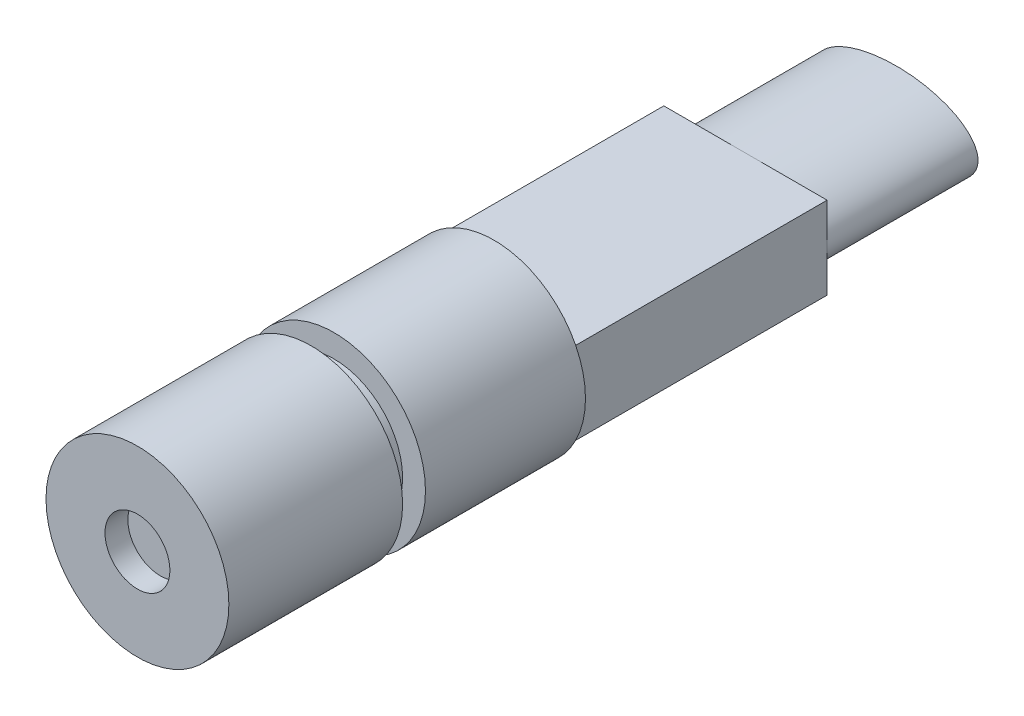
ISO-10303-21;
HEADER;
FILE_DESCRIPTION(('STEP AP214'),'2;1');
FILE_NAME('part.step','',(''),(''),'','','');
FILE_SCHEMA(('AUTOMOTIVE_DESIGN { 1 0 10303 214 1 1 1 1 }'));
ENDSEC;
DATA;
#1=APPLICATION_CONTEXT('core data for automotive mechanical design processes');
#2=APPLICATION_PROTOCOL_DEFINITION('international standard','automotive_design',2000,#1);
#3=PRODUCT_CONTEXT('',#1,'mechanical');
#4=PRODUCT('Part','Part','',(#3));
#5=PRODUCT_RELATED_PRODUCT_CATEGORY('part','',(#4));
#6=PRODUCT_DEFINITION_FORMATION('','',#4);
#7=PRODUCT_DEFINITION_CONTEXT('part definition',#1,'design');
#8=PRODUCT_DEFINITION('design','',#6,#7);
#9=PRODUCT_DEFINITION_SHAPE('','',#8);
#10=(LENGTH_UNIT() NAMED_UNIT(*) SI_UNIT(.MILLI.,.METRE.));
#11=(NAMED_UNIT(*) PLANE_ANGLE_UNIT() SI_UNIT($,.RADIAN.));
#12=(NAMED_UNIT(*) SI_UNIT($,.STERADIAN.) SOLID_ANGLE_UNIT());
#13=UNCERTAINTY_MEASURE_WITH_UNIT(LENGTH_MEASURE(1.E-05),#10,'distance_accuracy_value','');
#14=(GEOMETRIC_REPRESENTATION_CONTEXT(3) GLOBAL_UNCERTAINTY_ASSIGNED_CONTEXT((#13)) GLOBAL_UNIT_ASSIGNED_CONTEXT((#10,
#11,#12)) REPRESENTATION_CONTEXT('',''));
#15=CARTESIAN_POINT('',(0.,0.,0.));
#16=DIRECTION('',(0.,0.,1.));
#17=DIRECTION('',(1.,0.,0.));
#18=AXIS2_PLACEMENT_3D('',#15,#16,#17);
#19=CARTESIAN_POINT('',(0.,0.,-5.5));
#20=DIRECTION('',(0.,0.,1.));
#21=DIRECTION('',(1.,0.,0.));
#22=AXIS2_PLACEMENT_3D('',#19,#20,#21);
#23=PLANE('',#22);
#24=CARTESIAN_POINT('',(0.,0.,-5.5));
#25=DIRECTION('',(0.,0.,-1.));
#26=DIRECTION('',(-1.,0.,0.));
#27=AXIS2_PLACEMENT_3D('',#24,#25,#26);
#28=ELLIPSE('',#27,1.78605710994917,0.9);
#29=CARTESIAN_POINT('',(-1.78605710994917,0.,-5.5));
#30=VERTEX_POINT('',#29);
#31=CARTESIAN_POINT('',(0.,0.9,-5.5));
#32=VERTEX_POINT('',#31);
#33=EDGE_CURVE('E53',#30,#32,#28,.T.);
#34=ORIENTED_EDGE('',*,*,#33,.F.);
#35=DIRECTION('',(0.,-1.,0.));
#36=VECTOR('',#35,1.);
#37=CARTESIAN_POINT('',(-1.78605710994917,0.9,-5.5));
#38=LINE('',#37,#36);
#39=CARTESIAN_POINT('',(-1.78605710994917,0.9,-5.5));
#40=VERTEX_POINT('',#39);
#41=EDGE_CURVE('E100',#40,#30,#38,.T.);
#42=ORIENTED_EDGE('',*,*,#41,.F.);
#43=DIRECTION('',(-1.,0.,0.));
#44=VECTOR('',#43,1.);
#45=CARTESIAN_POINT('',(-1.78605710994917,0.9,-5.5));
#46=LINE('',#45,#44);
#47=EDGE_CURVE('E117',#32,#40,#46,.T.);
#48=ORIENTED_EDGE('',*,*,#47,.F.);
#49=EDGE_LOOP('',(#34,#42,#48));
#50=FACE_BOUND('',#49,.T.);
#51=ADVANCED_FACE('F41',(#50),#23,.F.);
#52=CARTESIAN_POINT('',(1.78605710994917,0.,-5.5));
#53=VERTEX_POINT('',#52);
#54=EDGE_CURVE('E11',#32,#53,#28,.T.);
#55=ORIENTED_EDGE('',*,*,#54,.F.);
#56=CARTESIAN_POINT('',(1.78605710994917,0.9,-5.5));
#57=VERTEX_POINT('',#56);
#58=EDGE_CURVE('E115',#57,#32,#46,.T.);
#59=ORIENTED_EDGE('',*,*,#58,.F.);
#60=DIRECTION('',(0.,1.,0.));
#61=VECTOR('',#60,1.);
#62=CARTESIAN_POINT('',(1.78605710994917,0.9,-5.5));
#63=LINE('',#62,#61);
#64=EDGE_CURVE('E136',#53,#57,#63,.T.);
#65=ORIENTED_EDGE('',*,*,#64,.F.);
#66=EDGE_LOOP('',(#55,#59,#65));
#67=FACE_BOUND('',#66,.T.);
#68=ADVANCED_FACE('F219',(#67),#23,.F.);
#69=CARTESIAN_POINT('',(0.,-0.9,-5.5));
#70=VERTEX_POINT('',#69);
#71=EDGE_CURVE('E51',#53,#70,#28,.T.);
#72=ORIENTED_EDGE('',*,*,#71,.F.);
#73=CARTESIAN_POINT('',(1.78605710994917,-0.9,-5.5));
#74=VERTEX_POINT('',#73);
#75=EDGE_CURVE('E132',#74,#53,#63,.T.);
#76=ORIENTED_EDGE('',*,*,#75,.F.);
#77=DIRECTION('',(1.,0.,0.));
#78=VECTOR('',#77,1.);
#79=CARTESIAN_POINT('',(-1.78605710994917,-0.9,-5.5));
#80=LINE('',#79,#78);
#81=EDGE_CURVE('E109',#70,#74,#80,.T.);
#82=ORIENTED_EDGE('',*,*,#81,.F.);
#83=EDGE_LOOP('',(#72,#76,#82));
#84=FACE_BOUND('',#83,.T.);
#85=ADVANCED_FACE('F224',(#84),#23,.F.);
#86=CARTESIAN_POINT('',(0.,0.,0.));
#87=DIRECTION('',(0.,0.,1.));
#88=DIRECTION('',(1.,0.,0.));
#89=AXIS2_PLACEMENT_3D('',#86,#87,#88);
#90=PLANE('',#89);
#91=CARTESIAN_POINT('',(0.,0.,0.));
#92=DIRECTION('',(0.,0.,1.));
#93=DIRECTION('',(1.,0.,0.));
#94=AXIS2_PLACEMENT_3D('',#91,#92,#93);
#95=CIRCLE('',#94,2.);
#96=CARTESIAN_POINT('',(1.78605710994918,-0.9,0.));
#97=VERTEX_POINT('',#96);
#98=CARTESIAN_POINT('',(1.78605710994917,0.9,0.));
#99=VERTEX_POINT('',#98);
#100=EDGE_CURVE('E190',#97,#99,#95,.T.);
#101=ORIENTED_EDGE('',*,*,#100,.F.);
#102=DIRECTION('',(0.,1.,0.));
#103=VECTOR('',#102,1.);
#104=CARTESIAN_POINT('',(1.78605710994917,0.9,0.));
#105=LINE('',#104,#103);
#106=EDGE_CURVE('E142',#97,#99,#105,.T.);
#107=ORIENTED_EDGE('',*,*,#106,.T.);
#108=EDGE_LOOP('',(#101,#107));
#109=FACE_BOUND('',#108,.T.);
#110=ADVANCED_FACE('F212',(#109),#90,.F.);
#111=CARTESIAN_POINT('',(-1.78605710994917,0.9,0.));
#112=VERTEX_POINT('',#111);
#113=EDGE_CURVE('E45',#99,#112,#95,.T.);
#114=ORIENTED_EDGE('',*,*,#113,.F.);
#115=DIRECTION('',(-1.,0.,0.));
#116=VECTOR('',#115,1.);
#117=CARTESIAN_POINT('',(-1.78605710994917,0.9,0.));
#118=LINE('',#117,#116);
#119=EDGE_CURVE('E146',#99,#112,#118,.T.);
#120=ORIENTED_EDGE('',*,*,#119,.T.);
#121=EDGE_LOOP('',(#114,#120));
#122=FACE_BOUND('',#121,.T.);
#123=ADVANCED_FACE('F242',(#122),#90,.F.);
#124=CARTESIAN_POINT('',(-1.78605710994917,-0.9,0.));
#125=VERTEX_POINT('',#124);
#126=EDGE_CURVE('E262',#112,#125,#95,.T.);
#127=ORIENTED_EDGE('',*,*,#126,.F.);
#128=DIRECTION('',(0.,-1.,0.));
#129=VECTOR('',#128,1.);
#130=CARTESIAN_POINT('',(-1.78605710994917,0.9,0.));
#131=LINE('',#130,#129);
#132=EDGE_CURVE('E150',#112,#125,#131,.T.);
#133=ORIENTED_EDGE('',*,*,#132,.T.);
#134=EDGE_LOOP('',(#127,#133));
#135=FACE_BOUND('',#134,.T.);
#136=ADVANCED_FACE('F213',(#135),#90,.F.);
#137=CARTESIAN_POINT('',(0.,0.,7.8));
#138=DIRECTION('',(0.,0.,-1.));
#139=DIRECTION('',(-1.,0.,0.));
#140=AXIS2_PLACEMENT_3D('',#137,#138,#139);
#141=CYLINDRICAL_SURFACE('',#140,2.);
#142=CARTESIAN_POINT('',(0.,0.,4.));
#143=DIRECTION('',(0.,0.,1.));
#144=DIRECTION('',(1.,0.,0.));
#145=AXIS2_PLACEMENT_3D('',#142,#143,#144);
#146=CIRCLE('',#145,2.);
#147=CARTESIAN_POINT('',(2.,0.,4.));
#148=VERTEX_POINT('',#147);
#149=EDGE_CURVE('E186',#148,#148,#146,.T.);
#150=ORIENTED_EDGE('',*,*,#149,.T.);
#151=EDGE_LOOP('',(#150));
#152=FACE_BOUND('',#151,.T.);
#153=CARTESIAN_POINT('',(0.,0.,7.8));
#154=DIRECTION('',(0.,0.,1.));
#155=DIRECTION('',(1.,0.,0.));
#156=AXIS2_PLACEMENT_3D('',#153,#154,#155);
#157=CIRCLE('',#156,2.);
#158=CARTESIAN_POINT('',(2.,0.,7.8));
#159=VERTEX_POINT('',#158);
#160=EDGE_CURVE('E125',#159,#159,#157,.T.);
#161=ORIENTED_EDGE('',*,*,#160,.F.);
#162=EDGE_LOOP('',(#161));
#163=FACE_BOUND('',#162,.T.);
#164=ADVANCED_FACE('F43',(#152,#163),#141,.T.);
#165=CARTESIAN_POINT('',(0.,0.,7.8));
#166=DIRECTION('',(0.,0.,1.));
#167=DIRECTION('',(1.,0.,0.));
#168=AXIS2_PLACEMENT_3D('',#165,#166,#167);
#169=PLANE('',#168);
#170=CARTESIAN_POINT('',(0.,0.,7.8));
#171=DIRECTION('',(0.,0.,1.));
#172=DIRECTION('',(1.,0.,0.));
#173=AXIS2_PLACEMENT_3D('',#170,#171,#172);
#174=CIRCLE('',#173,0.71);
#175=CARTESIAN_POINT('',(0.71,0.,7.8));
#176=VERTEX_POINT('',#175);
#177=EDGE_CURVE('E162',#176,#176,#174,.T.);
#178=ORIENTED_EDGE('',*,*,#177,.F.);
#179=EDGE_LOOP('',(#178));
#180=FACE_BOUND('',#179,.T.);
#181=ORIENTED_EDGE('',*,*,#160,.T.);
#182=EDGE_LOOP('',(#181));
#183=FACE_BOUND('',#182,.T.);
#184=ADVANCED_FACE('F216',(#180,#183),#169,.T.);
#185=CARTESIAN_POINT('',(0.,0.,4.));
#186=DIRECTION('',(0.,0.,1.));
#187=DIRECTION('',(1.,0.,0.));
#188=AXIS2_PLACEMENT_3D('',#185,#186,#187);
#189=PLANE('',#188);
#190=ORIENTED_EDGE('',*,*,#149,.F.);
#191=EDGE_LOOP('',(#190));
#192=FACE_BOUND('',#191,.T.);
#193=CARTESIAN_POINT('',(0.,0.,4.));
#194=DIRECTION('',(0.,0.,1.));
#195=DIRECTION('',(1.,0.,0.));
#196=AXIS2_PLACEMENT_3D('',#193,#194,#195);
#197=CIRCLE('',#196,1.5);
#198=CARTESIAN_POINT('',(1.5,0.,4.));
#199=VERTEX_POINT('',#198);
#200=EDGE_CURVE('E178',#199,#199,#197,.T.);
#201=ORIENTED_EDGE('',*,*,#200,.T.);
#202=EDGE_LOOP('',(#201));
#203=FACE_BOUND('',#202,.T.);
#204=ADVANCED_FACE('F276',(#192,#203),#189,.F.);
#205=CARTESIAN_POINT('',(0.,0.,3.5));
#206=DIRECTION('',(0.,0.,1.));
#207=DIRECTION('',(1.,0.,0.));
#208=AXIS2_PLACEMENT_3D('',#205,#206,#207);
#209=PLANE('',#208);
#210=CARTESIAN_POINT('',(0.,0.,3.5));
#211=DIRECTION('',(0.,0.,1.));
#212=DIRECTION('',(1.,0.,0.));
#213=AXIS2_PLACEMENT_3D('',#210,#211,#212);
#214=CIRCLE('',#213,2.);
#215=CARTESIAN_POINT('',(2.,0.,3.5));
#216=VERTEX_POINT('',#215);
#217=EDGE_CURVE('E182',#216,#216,#214,.T.);
#218=ORIENTED_EDGE('',*,*,#217,.T.);
#219=EDGE_LOOP('',(#218));
#220=FACE_BOUND('',#219,.T.);
#221=CARTESIAN_POINT('',(0.,0.,3.5));
#222=DIRECTION('',(0.,0.,1.));
#223=DIRECTION('',(1.,0.,0.));
#224=AXIS2_PLACEMENT_3D('',#221,#222,#223);
#225=CIRCLE('',#224,1.5);
#226=CARTESIAN_POINT('',(1.5,0.,3.5));
#227=VERTEX_POINT('',#226);
#228=EDGE_CURVE('E174',#227,#227,#225,.T.);
#229=ORIENTED_EDGE('',*,*,#228,.F.);
#230=EDGE_LOOP('',(#229));
#231=FACE_BOUND('',#230,.T.);
#232=ADVANCED_FACE('F195',(#220,#231),#209,.T.);
#233=CARTESIAN_POINT('',(0.,0.,4.));
#234=DIRECTION('',(0.,0.,-1.));
#235=DIRECTION('',(-1.,0.,0.));
#236=AXIS2_PLACEMENT_3D('',#233,#234,#235);
#237=CYLINDRICAL_SURFACE('',#236,1.5);
#238=ORIENTED_EDGE('',*,*,#200,.F.);
#239=EDGE_LOOP('',(#238));
#240=FACE_BOUND('',#239,.T.);
#241=ORIENTED_EDGE('',*,*,#228,.T.);
#242=EDGE_LOOP('',(#241));
#243=FACE_BOUND('',#242,.T.);
#244=ADVANCED_FACE('F210',(#240,#243),#237,.T.);
#245=EDGE_CURVE('E256',#125,#97,#95,.T.);
#246=ORIENTED_EDGE('',*,*,#245,.F.);
#247=DIRECTION('',(1.,0.,0.));
#248=VECTOR('',#247,1.);
#249=CARTESIAN_POINT('',(-1.78605710994917,-0.9,0.));
#250=LINE('',#249,#248);
#251=EDGE_CURVE('E154',#125,#97,#250,.T.);
#252=ORIENTED_EDGE('',*,*,#251,.T.);
#253=EDGE_LOOP('',(#246,#252));
#254=FACE_BOUND('',#253,.T.);
#255=ADVANCED_FACE('F201',(#254),#90,.F.);
#256=ORIENTED_EDGE('',*,*,#113,.T.);
#257=ORIENTED_EDGE('',*,*,#126,.T.);
#258=ORIENTED_EDGE('',*,*,#245,.T.);
#259=ORIENTED_EDGE('',*,*,#100,.T.);
#260=EDGE_LOOP('',(#256,#257,#258,#259));
#261=FACE_BOUND('',#260,.T.);
#262=ORIENTED_EDGE('',*,*,#217,.F.);
#263=EDGE_LOOP('',(#262));
#264=FACE_BOUND('',#263,.T.);
#265=ADVANCED_FACE('F198',(#261,#264),#141,.T.);
#266=CARTESIAN_POINT('',(0.,0.,7.3));
#267=DIRECTION('',(0.,0.,1.));
#268=DIRECTION('',(1.,0.,0.));
#269=AXIS2_PLACEMENT_3D('',#266,#267,#268);
#270=CYLINDRICAL_SURFACE('',#269,0.71);
#271=CARTESIAN_POINT('',(0.,0.,7.3));
#272=DIRECTION('',(0.,0.,1.));
#273=DIRECTION('',(1.,0.,0.));
#274=AXIS2_PLACEMENT_3D('',#271,#272,#273);
#275=CIRCLE('',#274,0.71);
#276=CARTESIAN_POINT('',(0.71,0.,7.3));
#277=VERTEX_POINT('',#276);
#278=EDGE_CURVE('E170',#277,#277,#275,.T.);
#279=ORIENTED_EDGE('',*,*,#278,.F.);
#280=EDGE_LOOP('',(#279));
#281=FACE_BOUND('',#280,.T.);
#282=ORIENTED_EDGE('',*,*,#177,.T.);
#283=EDGE_LOOP('',(#282));
#284=FACE_BOUND('',#283,.T.);
#285=ADVANCED_FACE('F200',(#281,#284),#270,.F.);
#286=CARTESIAN_POINT('',(0.,0.,7.3));
#287=DIRECTION('',(0.,0.,1.));
#288=DIRECTION('',(1.,0.,0.));
#289=AXIS2_PLACEMENT_3D('',#286,#287,#288);
#290=PLANE('',#289);
#291=ORIENTED_EDGE('',*,*,#278,.T.);
#292=EDGE_LOOP('',(#291));
#293=FACE_BOUND('',#292,.T.);
#294=ADVANCED_FACE('F207',(#293),#290,.T.);
#295=CARTESIAN_POINT('',(1.78605710994917,0.9,-5.5));
#296=DIRECTION('',(1.,0.,0.));
#297=DIRECTION('',(0.,0.,-1.));
#298=AXIS2_PLACEMENT_3D('',#295,#296,#297);
#299=PLANE('',#298);
#300=ORIENTED_EDGE('',*,*,#106,.F.);
#301=DIRECTION('',(0.,0.,1.));
#302=VECTOR('',#301,1.);
#303=CARTESIAN_POINT('',(1.78605710994917,-0.9,-5.5));
#304=LINE('',#303,#302);
#305=EDGE_CURVE('E158',#74,#97,#304,.T.);
#306=ORIENTED_EDGE('',*,*,#305,.F.);
#307=ORIENTED_EDGE('',*,*,#75,.T.);
#308=ORIENTED_EDGE('',*,*,#64,.T.);
#309=DIRECTION('',(0.,0.,1.));
#310=VECTOR('',#309,1.);
#311=CARTESIAN_POINT('',(1.78605710994917,0.9,-5.5));
#312=LINE('',#311,#310);
#313=EDGE_CURVE('E141',#57,#99,#312,.T.);
#314=ORIENTED_EDGE('',*,*,#313,.T.);
#315=EDGE_LOOP('',(#300,#306,#307,#308,#314));
#316=FACE_BOUND('',#315,.T.);
#317=ADVANCED_FACE('F249',(#316),#299,.T.);
#318=CARTESIAN_POINT('',(-1.78605710994917,-0.9,-5.5));
#319=DIRECTION('',(0.,-1.,0.));
#320=DIRECTION('',(0.,0.,-1.));
#321=AXIS2_PLACEMENT_3D('',#318,#319,#320);
#322=PLANE('',#321);
#323=ORIENTED_EDGE('',*,*,#251,.F.);
#324=DIRECTION('',(0.,0.,1.));
#325=VECTOR('',#324,1.);
#326=CARTESIAN_POINT('',(-1.78605710994917,-0.9,-5.5));
#327=LINE('',#326,#325);
#328=CARTESIAN_POINT('',(-1.78605710994917,-0.9,-5.5));
#329=VERTEX_POINT('',#328);
#330=EDGE_CURVE('E163',#329,#125,#327,.T.);
#331=ORIENTED_EDGE('',*,*,#330,.F.);
#332=EDGE_CURVE('E113',#329,#70,#80,.T.);
#333=ORIENTED_EDGE('',*,*,#332,.T.);
#334=ORIENTED_EDGE('',*,*,#81,.T.);
#335=ORIENTED_EDGE('',*,*,#305,.T.);
#336=EDGE_LOOP('',(#323,#331,#333,#334,#335));
#337=FACE_BOUND('',#336,.T.);
#338=ADVANCED_FACE('F252',(#337),#322,.T.);
#339=CARTESIAN_POINT('',(-1.78605710994917,0.9,-5.5));
#340=DIRECTION('',(-1.,0.,0.));
#341=DIRECTION('',(0.,0.,1.));
#342=AXIS2_PLACEMENT_3D('',#339,#340,#341);
#343=PLANE('',#342);
#344=ORIENTED_EDGE('',*,*,#132,.F.);
#345=DIRECTION('',(0.,0.,1.));
#346=VECTOR('',#345,1.);
#347=CARTESIAN_POINT('',(-1.78605710994917,0.9,-5.5));
#348=LINE('',#347,#346);
#349=EDGE_CURVE('E105',#40,#112,#348,.T.);
#350=ORIENTED_EDGE('',*,*,#349,.F.);
#351=ORIENTED_EDGE('',*,*,#41,.T.);
#352=EDGE_CURVE('E103',#30,#329,#38,.T.);
#353=ORIENTED_EDGE('',*,*,#352,.T.);
#354=ORIENTED_EDGE('',*,*,#330,.T.);
#355=EDGE_LOOP('',(#344,#350,#351,#353,#354));
#356=FACE_BOUND('',#355,.T.);
#357=ADVANCED_FACE('F102',(#356),#343,.T.);
#358=CARTESIAN_POINT('',(-1.78605710994917,0.9,-5.5));
#359=DIRECTION('',(0.,1.,0.));
#360=DIRECTION('',(0.,0.,1.));
#361=AXIS2_PLACEMENT_3D('',#358,#359,#360);
#362=PLANE('',#361);
#363=ORIENTED_EDGE('',*,*,#119,.F.);
#364=ORIENTED_EDGE('',*,*,#313,.F.);
#365=ORIENTED_EDGE('',*,*,#58,.T.);
#366=ORIENTED_EDGE('',*,*,#47,.T.);
#367=ORIENTED_EDGE('',*,*,#349,.T.);
#368=EDGE_LOOP('',(#363,#364,#365,#366,#367));
#369=FACE_BOUND('',#368,.T.);
#370=ADVANCED_FACE('F228',(#369),#362,.T.);
#371=EDGE_CURVE('E66',#70,#30,#28,.T.);
#372=ORIENTED_EDGE('',*,*,#371,.F.);
#373=ORIENTED_EDGE('',*,*,#332,.F.);
#374=ORIENTED_EDGE('',*,*,#352,.F.);
#375=EDGE_LOOP('',(#372,#373,#374));
#376=FACE_BOUND('',#375,.T.);
#377=ADVANCED_FACE('F111',(#376),#23,.F.);
#378=CARTESIAN_POINT('',(0.,0.,-8.8));
#379=DIRECTION('',(0.,0.,-1.));
#380=DIRECTION('',(-1.,0.,0.));
#381=AXIS2_PLACEMENT_3D('',#378,#379,#380);
#382=ELLIPSE('',#381,1.78605710994917,0.9);
#383=DIRECTION('',(0.,0.,1.));
#384=VECTOR('',#383,1.);
#385=SURFACE_OF_LINEAR_EXTRUSION('',#382,#384);
#386=CARTESIAN_POINT('',(-1.78605710994917,0.,-8.8));
#387=VERTEX_POINT('',#386);
#388=EDGE_CURVE('E121',#387,#387,#382,.T.);
#389=ORIENTED_EDGE('',*,*,#388,.F.);
#390=EDGE_LOOP('',(#389));
#391=FACE_BOUND('',#390,.T.);
#392=ORIENTED_EDGE('',*,*,#33,.T.);
#393=ORIENTED_EDGE('',*,*,#54,.T.);
#394=ORIENTED_EDGE('',*,*,#71,.T.);
#395=ORIENTED_EDGE('',*,*,#371,.T.);
#396=EDGE_LOOP('',(#392,#393,#394,#395));
#397=FACE_BOUND('',#396,.T.);
#398=ADVANCED_FACE('F123',(#391,#397),#385,.F.);
#399=CARTESIAN_POINT('',(0.,0.,-8.8));
#400=DIRECTION('',(0.,0.,-1.));
#401=DIRECTION('',(-1.,0.,0.));
#402=AXIS2_PLACEMENT_3D('',#399,#400,#401);
#403=PLANE('',#402);
#404=ORIENTED_EDGE('',*,*,#388,.T.);
#405=EDGE_LOOP('',(#404));
#406=FACE_BOUND('',#405,.T.);
#407=ADVANCED_FACE('F233',(#406),#403,.T.);
#408=CLOSED_SHELL('',(#51,#68,#85,#110,#123,#136,#164,#184,#204,#232,#244,#255,#265,#285,#294,
#317,#338,#357,#370,#377,#398,#407));
#409=MANIFOLD_SOLID_BREP('B2',#408);
#410=ADVANCED_BREP_SHAPE_REPRESENTATION('',(#18,#409),#14);
#411=SHAPE_DEFINITION_REPRESENTATION(#9,#410);
ENDSEC;
END-ISO-10303-21;
